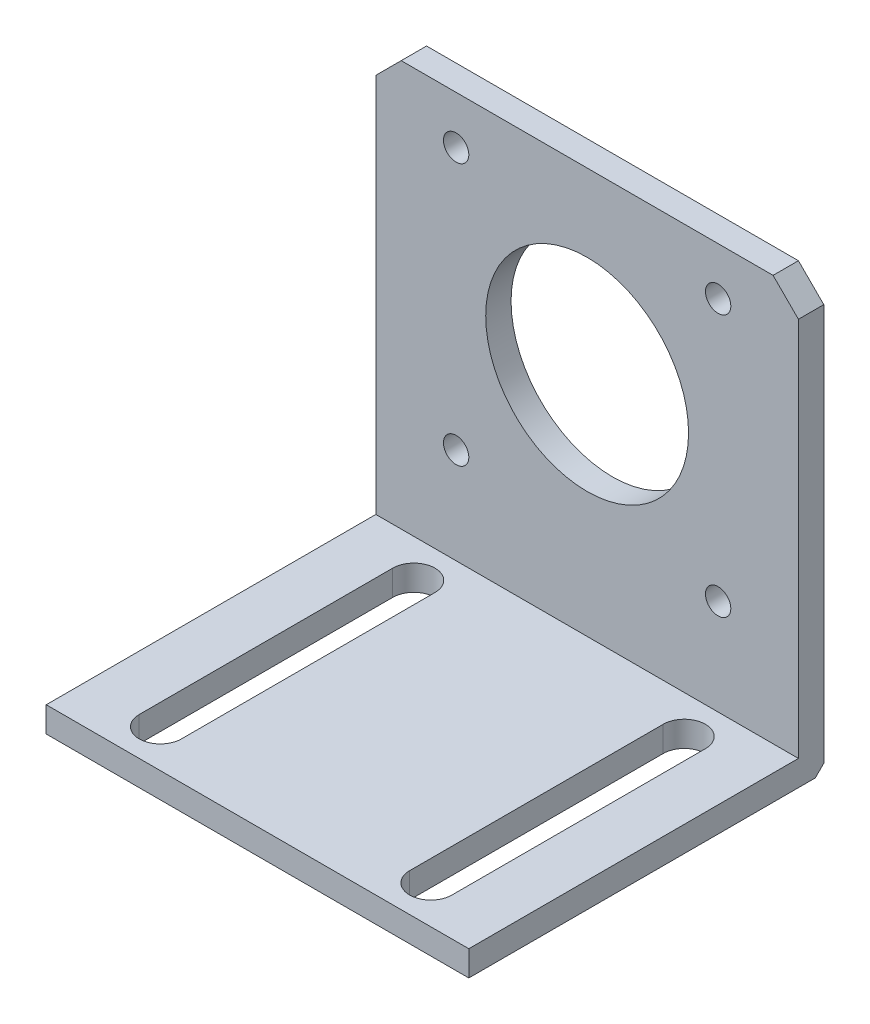
ISO-10303-21;
HEADER;
FILE_DESCRIPTION(('STEP AP214'),'2;1');
FILE_NAME('part.step','',(''),(''),'','','');
FILE_SCHEMA(('AUTOMOTIVE_DESIGN { 1 0 10303 214 1 1 1 1 }'));
ENDSEC;
DATA;
#1=APPLICATION_CONTEXT('core data for automotive mechanical design processes');
#2=APPLICATION_PROTOCOL_DEFINITION('international standard','automotive_design',2000,#1);
#3=PRODUCT_CONTEXT('',#1,'mechanical');
#4=PRODUCT('Part','Part','',(#3));
#5=PRODUCT_RELATED_PRODUCT_CATEGORY('part','',(#4));
#6=PRODUCT_DEFINITION_FORMATION('','',#4);
#7=PRODUCT_DEFINITION_CONTEXT('part definition',#1,'design');
#8=PRODUCT_DEFINITION('design','',#6,#7);
#9=PRODUCT_DEFINITION_SHAPE('','',#8);
#10=(LENGTH_UNIT() NAMED_UNIT(*) SI_UNIT(.MILLI.,.METRE.));
#11=(NAMED_UNIT(*) PLANE_ANGLE_UNIT() SI_UNIT($,.RADIAN.));
#12=(NAMED_UNIT(*) SI_UNIT($,.STERADIAN.) SOLID_ANGLE_UNIT());
#13=UNCERTAINTY_MEASURE_WITH_UNIT(LENGTH_MEASURE(1.E-05),#10,'distance_accuracy_value','');
#14=(GEOMETRIC_REPRESENTATION_CONTEXT(3) GLOBAL_UNCERTAINTY_ASSIGNED_CONTEXT((#13)) GLOBAL_UNIT_ASSIGNED_CONTEXT((#10,
#11,#12)) REPRESENTATION_CONTEXT('',''));
#15=CARTESIAN_POINT('',(0.,0.,0.));
#16=DIRECTION('',(0.,0.,1.));
#17=DIRECTION('',(1.,0.,0.));
#18=AXIS2_PLACEMENT_3D('',#15,#16,#17);
#19=CARTESIAN_POINT('',(0.,0.,3.));
#20=DIRECTION('',(0.,0.,1.));
#21=DIRECTION('',(1.,0.,0.));
#22=AXIS2_PLACEMENT_3D('',#19,#20,#21);
#23=PLANE('',#22);
#24=DIRECTION('',(-1.,0.,0.));
#25=VECTOR('',#24,1.);
#26=CARTESIAN_POINT('',(-25.,-26.85,3.));
#27=LINE('',#26,#25);
#28=CARTESIAN_POINT('',(25.,-26.85,3.));
#29=VERTEX_POINT('',#28);
#30=CARTESIAN_POINT('',(-25.,-26.85,3.));
#31=VERTEX_POINT('',#30);
#32=EDGE_CURVE('E193',#29,#31,#27,.T.);
#33=ORIENTED_EDGE('',*,*,#32,.F.);
#34=DIRECTION('',(0.,1.,0.));
#35=VECTOR('',#34,1.);
#36=CARTESIAN_POINT('',(25.,18.15,3.));
#37=LINE('',#36,#35);
#38=CARTESIAN_POINT('',(25.,18.15,3.));
#39=VERTEX_POINT('',#38);
#40=EDGE_CURVE('E289',#29,#39,#37,.T.);
#41=ORIENTED_EDGE('',*,*,#40,.T.);
#42=DIRECTION('',(-0.707106781186548,0.707106781186548,0.));
#43=VECTOR('',#42,1.);
#44=CARTESIAN_POINT('',(25.,18.15,3.));
#45=LINE('',#44,#43);
#46=CARTESIAN_POINT('',(22.,21.15,3.));
#47=VERTEX_POINT('',#46);
#48=EDGE_CURVE('E291',#39,#47,#45,.T.);
#49=ORIENTED_EDGE('',*,*,#48,.T.);
#50=DIRECTION('',(-1.,0.,0.));
#51=VECTOR('',#50,1.);
#52=CARTESIAN_POINT('',(22.,21.15,3.));
#53=LINE('',#52,#51);
#54=CARTESIAN_POINT('',(-22.,21.15,3.));
#55=VERTEX_POINT('',#54);
#56=EDGE_CURVE('E281',#47,#55,#53,.T.);
#57=ORIENTED_EDGE('',*,*,#56,.T.);
#58=DIRECTION('',(-0.707106781186548,-0.707106781186548,0.));
#59=VECTOR('',#58,1.);
#60=CARTESIAN_POINT('',(-22.,21.15,3.));
#61=LINE('',#60,#59);
#62=CARTESIAN_POINT('',(-25.,18.15,3.));
#63=VERTEX_POINT('',#62);
#64=EDGE_CURVE('E284',#55,#63,#61,.T.);
#65=ORIENTED_EDGE('',*,*,#64,.T.);
#66=DIRECTION('',(0.,-1.,0.));
#67=VECTOR('',#66,1.);
#68=CARTESIAN_POINT('',(-25.,18.15,3.));
#69=LINE('',#68,#67);
#70=EDGE_CURVE('E287',#63,#31,#69,.T.);
#71=ORIENTED_EDGE('',*,*,#70,.T.);
#72=EDGE_LOOP('',(#33,#41,#49,#57,#65,#71));
#73=FACE_BOUND('',#72,.T.);
#74=CARTESIAN_POINT('',(-15.5,-15.5,3.));
#75=DIRECTION('',(0.,0.,1.));
#76=DIRECTION('',(-1.,0.,0.));
#77=AXIS2_PLACEMENT_3D('',#74,#75,#76);
#78=CIRCLE('',#77,1.5);
#79=CARTESIAN_POINT('',(-17.,-15.5,3.));
#80=VERTEX_POINT('',#79);
#81=EDGE_CURVE('E257',#80,#80,#78,.T.);
#82=ORIENTED_EDGE('',*,*,#81,.F.);
#83=EDGE_LOOP('',(#82));
#84=FACE_BOUND('',#83,.T.);
#85=CARTESIAN_POINT('',(0.,0.,3.));
#86=DIRECTION('',(0.,0.,1.));
#87=DIRECTION('',(1.,0.,0.));
#88=AXIS2_PLACEMENT_3D('',#85,#86,#87);
#89=CIRCLE('',#88,12.);
#90=CARTESIAN_POINT('',(12.,0.,3.));
#91=VERTEX_POINT('',#90);
#92=EDGE_CURVE('E269',#91,#91,#89,.T.);
#93=ORIENTED_EDGE('',*,*,#92,.F.);
#94=EDGE_LOOP('',(#93));
#95=FACE_BOUND('',#94,.T.);
#96=CARTESIAN_POINT('',(-15.5,15.5,3.));
#97=DIRECTION('',(0.,0.,1.));
#98=DIRECTION('',(1.,0.,0.));
#99=AXIS2_PLACEMENT_3D('',#96,#97,#98);
#100=CIRCLE('',#99,1.5);
#101=CARTESIAN_POINT('',(-14.,15.5,3.));
#102=VERTEX_POINT('',#101);
#103=EDGE_CURVE('E275',#102,#102,#100,.T.);
#104=ORIENTED_EDGE('',*,*,#103,.F.);
#105=EDGE_LOOP('',(#104));
#106=FACE_BOUND('',#105,.T.);
#107=CARTESIAN_POINT('',(15.5,15.5,3.));
#108=DIRECTION('',(0.,0.,1.));
#109=DIRECTION('',(-1.,0.,0.));
#110=AXIS2_PLACEMENT_3D('',#107,#108,#109);
#111=CIRCLE('',#110,1.5);
#112=CARTESIAN_POINT('',(14.,15.5,3.));
#113=VERTEX_POINT('',#112);
#114=EDGE_CURVE('E263',#113,#113,#111,.T.);
#115=ORIENTED_EDGE('',*,*,#114,.F.);
#116=EDGE_LOOP('',(#115));
#117=FACE_BOUND('',#116,.T.);
#118=CARTESIAN_POINT('',(15.5,-15.5,3.));
#119=DIRECTION('',(0.,0.,1.));
#120=DIRECTION('',(1.,0.,0.));
#121=AXIS2_PLACEMENT_3D('',#118,#119,#120);
#122=CIRCLE('',#121,1.5);
#123=CARTESIAN_POINT('',(17.,-15.5,3.));
#124=VERTEX_POINT('',#123);
#125=EDGE_CURVE('E251',#124,#124,#122,.T.);
#126=ORIENTED_EDGE('',*,*,#125,.F.);
#127=EDGE_LOOP('',(#126));
#128=FACE_BOUND('',#127,.T.);
#129=ADVANCED_FACE('F37',(#73,#84,#95,#106,#117,#128),#23,.T.);
#130=CARTESIAN_POINT('',(0.,0.,0.));
#131=DIRECTION('',(0.,0.,1.));
#132=DIRECTION('',(1.,0.,0.));
#133=AXIS2_PLACEMENT_3D('',#130,#131,#132);
#134=PLANE('',#133);
#135=DIRECTION('',(0.,1.,0.));
#136=VECTOR('',#135,1.);
#137=CARTESIAN_POINT('',(25.,18.15,0.));
#138=LINE('',#137,#136);
#139=CARTESIAN_POINT('',(25.,-28.85,0.));
#140=VERTEX_POINT('',#139);
#141=CARTESIAN_POINT('',(25.,18.15,0.));
#142=VERTEX_POINT('',#141);
#143=EDGE_CURVE('E301',#140,#142,#138,.T.);
#144=ORIENTED_EDGE('',*,*,#143,.F.);
#145=DIRECTION('',(-1.,0.,0.));
#146=VECTOR('',#145,1.);
#147=CARTESIAN_POINT('',(-25.,-28.85,0.));
#148=LINE('',#147,#146);
#149=CARTESIAN_POINT('',(-25.,-28.85,0.));
#150=VERTEX_POINT('',#149);
#151=EDGE_CURVE('E315',#140,#150,#148,.T.);
#152=ORIENTED_EDGE('',*,*,#151,.T.);
#153=DIRECTION('',(0.,-1.,0.));
#154=VECTOR('',#153,1.);
#155=CARTESIAN_POINT('',(-25.,18.15,0.));
#156=LINE('',#155,#154);
#157=CARTESIAN_POINT('',(-25.,18.15,0.));
#158=VERTEX_POINT('',#157);
#159=EDGE_CURVE('E298',#158,#150,#156,.T.);
#160=ORIENTED_EDGE('',*,*,#159,.F.);
#161=DIRECTION('',(-0.707106781186548,-0.707106781186548,0.));
#162=VECTOR('',#161,1.);
#163=CARTESIAN_POINT('',(-22.,21.15,0.));
#164=LINE('',#163,#162);
#165=CARTESIAN_POINT('',(-22.,21.15,0.));
#166=VERTEX_POINT('',#165);
#167=EDGE_CURVE('E296',#166,#158,#164,.T.);
#168=ORIENTED_EDGE('',*,*,#167,.F.);
#169=DIRECTION('',(-1.,0.,0.));
#170=VECTOR('',#169,1.);
#171=CARTESIAN_POINT('',(22.,21.15,0.));
#172=LINE('',#171,#170);
#173=CARTESIAN_POINT('',(22.,21.15,0.));
#174=VERTEX_POINT('',#173);
#175=EDGE_CURVE('E278',#174,#166,#172,.T.);
#176=ORIENTED_EDGE('',*,*,#175,.F.);
#177=DIRECTION('',(-0.707106781186548,0.707106781186548,0.));
#178=VECTOR('',#177,1.);
#179=CARTESIAN_POINT('',(25.,18.15,0.));
#180=LINE('',#179,#178);
#181=EDGE_CURVE('E285',#142,#174,#180,.T.);
#182=ORIENTED_EDGE('',*,*,#181,.F.);
#183=EDGE_LOOP('',(#144,#152,#160,#168,#176,#182));
#184=FACE_BOUND('',#183,.T.);
#185=CARTESIAN_POINT('',(-15.5,15.5,0.));
#186=DIRECTION('',(0.,0.,1.));
#187=DIRECTION('',(1.,0.,0.));
#188=AXIS2_PLACEMENT_3D('',#185,#186,#187);
#189=CIRCLE('',#188,1.5);
#190=CARTESIAN_POINT('',(-14.,15.5,0.));
#191=VERTEX_POINT('',#190);
#192=EDGE_CURVE('E272',#191,#191,#189,.T.);
#193=ORIENTED_EDGE('',*,*,#192,.T.);
#194=EDGE_LOOP('',(#193));
#195=FACE_BOUND('',#194,.T.);
#196=CARTESIAN_POINT('',(0.,0.,0.));
#197=DIRECTION('',(0.,0.,1.));
#198=DIRECTION('',(1.,0.,0.));
#199=AXIS2_PLACEMENT_3D('',#196,#197,#198);
#200=CIRCLE('',#199,12.);
#201=CARTESIAN_POINT('',(12.,0.,0.));
#202=VERTEX_POINT('',#201);
#203=EDGE_CURVE('E266',#202,#202,#200,.T.);
#204=ORIENTED_EDGE('',*,*,#203,.T.);
#205=EDGE_LOOP('',(#204));
#206=FACE_BOUND('',#205,.T.);
#207=CARTESIAN_POINT('',(15.5,15.5,0.));
#208=DIRECTION('',(0.,0.,1.));
#209=DIRECTION('',(-1.,0.,0.));
#210=AXIS2_PLACEMENT_3D('',#207,#208,#209);
#211=CIRCLE('',#210,1.5);
#212=CARTESIAN_POINT('',(14.,15.5,0.));
#213=VERTEX_POINT('',#212);
#214=EDGE_CURVE('E260',#213,#213,#211,.T.);
#215=ORIENTED_EDGE('',*,*,#214,.T.);
#216=EDGE_LOOP('',(#215));
#217=FACE_BOUND('',#216,.T.);
#218=CARTESIAN_POINT('',(-15.5,-15.5,0.));
#219=DIRECTION('',(0.,0.,1.));
#220=DIRECTION('',(-1.,0.,0.));
#221=AXIS2_PLACEMENT_3D('',#218,#219,#220);
#222=CIRCLE('',#221,1.5);
#223=CARTESIAN_POINT('',(-17.,-15.5,0.));
#224=VERTEX_POINT('',#223);
#225=EDGE_CURVE('E254',#224,#224,#222,.T.);
#226=ORIENTED_EDGE('',*,*,#225,.T.);
#227=EDGE_LOOP('',(#226));
#228=FACE_BOUND('',#227,.T.);
#229=CARTESIAN_POINT('',(15.5,-15.5,0.));
#230=DIRECTION('',(0.,0.,1.));
#231=DIRECTION('',(1.,0.,0.));
#232=AXIS2_PLACEMENT_3D('',#229,#230,#231);
#233=CIRCLE('',#232,1.5);
#234=CARTESIAN_POINT('',(17.,-15.5,0.));
#235=VERTEX_POINT('',#234);
#236=EDGE_CURVE('E248',#235,#235,#233,.T.);
#237=ORIENTED_EDGE('',*,*,#236,.T.);
#238=EDGE_LOOP('',(#237));
#239=FACE_BOUND('',#238,.T.);
#240=ADVANCED_FACE('F332',(#184,#195,#206,#217,#228,#239),#134,.F.);
#241=CARTESIAN_POINT('',(22.,21.15,3.));
#242=DIRECTION('',(0.,-1.,0.));
#243=DIRECTION('',(1.,0.,0.));
#244=AXIS2_PLACEMENT_3D('',#241,#242,#243);
#245=PLANE('',#244);
#246=ORIENTED_EDGE('',*,*,#175,.T.);
#247=DIRECTION('',(0.,0.,-1.));
#248=VECTOR('',#247,1.);
#249=CARTESIAN_POINT('',(-22.,21.15,3.));
#250=LINE('',#249,#248);
#251=EDGE_CURVE('E312',#55,#166,#250,.T.);
#252=ORIENTED_EDGE('',*,*,#251,.F.);
#253=ORIENTED_EDGE('',*,*,#56,.F.);
#254=DIRECTION('',(0.,0.,-1.));
#255=VECTOR('',#254,1.);
#256=CARTESIAN_POINT('',(22.,21.15,3.));
#257=LINE('',#256,#255);
#258=EDGE_CURVE('E293',#47,#174,#257,.T.);
#259=ORIENTED_EDGE('',*,*,#258,.T.);
#260=EDGE_LOOP('',(#246,#252,#253,#259));
#261=FACE_BOUND('',#260,.T.);
#262=ADVANCED_FACE('F344',(#261),#245,.F.);
#263=CARTESIAN_POINT('',(-22.,21.15,3.));
#264=DIRECTION('',(0.707106781186547,-0.707106781186547,0.));
#265=DIRECTION('',(0.707106781186548,0.707106781186548,0.));
#266=AXIS2_PLACEMENT_3D('',#263,#264,#265);
#267=PLANE('',#266);
#268=ORIENTED_EDGE('',*,*,#167,.T.);
#269=DIRECTION('',(0.,0.,-1.));
#270=VECTOR('',#269,1.);
#271=CARTESIAN_POINT('',(-25.,18.15,3.));
#272=LINE('',#271,#270);
#273=EDGE_CURVE('E309',#63,#158,#272,.T.);
#274=ORIENTED_EDGE('',*,*,#273,.F.);
#275=ORIENTED_EDGE('',*,*,#64,.F.);
#276=ORIENTED_EDGE('',*,*,#251,.T.);
#277=EDGE_LOOP('',(#268,#274,#275,#276));
#278=FACE_BOUND('',#277,.T.);
#279=ADVANCED_FACE('F340',(#278),#267,.F.);
#280=CARTESIAN_POINT('',(-25.,18.15,3.));
#281=DIRECTION('',(1.,0.,0.));
#282=DIRECTION('',(0.,1.,0.));
#283=AXIS2_PLACEMENT_3D('',#280,#281,#282);
#284=PLANE('',#283);
#285=ORIENTED_EDGE('',*,*,#159,.T.);
#286=DIRECTION('',(0.,-0.707106781186548,0.707106781186548));
#287=VECTOR('',#286,1.);
#288=CARTESIAN_POINT('',(-25.,-28.85,0.));
#289=LINE('',#288,#287);
#290=CARTESIAN_POINT('',(-25.,-29.85,0.999999999999994));
#291=VERTEX_POINT('',#290);
#292=EDGE_CURVE('E318',#150,#291,#289,.T.);
#293=ORIENTED_EDGE('',*,*,#292,.T.);
#294=DIRECTION('',(0.,0.,-1.));
#295=VECTOR('',#294,1.);
#296=CARTESIAN_POINT('',(-25.,-29.85,3.));
#297=LINE('',#296,#295);
#298=CARTESIAN_POINT('',(-25.,-29.85,42.));
#299=VERTEX_POINT('',#298);
#300=EDGE_CURVE('E245',#299,#291,#297,.T.);
#301=ORIENTED_EDGE('',*,*,#300,.F.);
#302=DIRECTION('',(0.,-1.,0.));
#303=VECTOR('',#302,1.);
#304=CARTESIAN_POINT('',(-25.,-29.85,42.));
#305=LINE('',#304,#303);
#306=CARTESIAN_POINT('',(-25.,-26.85,42.));
#307=VERTEX_POINT('',#306);
#308=EDGE_CURVE('E233',#307,#299,#305,.T.);
#309=ORIENTED_EDGE('',*,*,#308,.F.);
#310=DIRECTION('',(0.,0.,-1.));
#311=VECTOR('',#310,1.);
#312=CARTESIAN_POINT('',(-25.,-26.85,42.));
#313=LINE('',#312,#311);
#314=EDGE_CURVE('E236',#307,#31,#313,.T.);
#315=ORIENTED_EDGE('',*,*,#314,.T.);
#316=ORIENTED_EDGE('',*,*,#70,.F.);
#317=ORIENTED_EDGE('',*,*,#273,.T.);
#318=EDGE_LOOP('',(#285,#293,#301,#309,#315,#316,#317));
#319=FACE_BOUND('',#318,.T.);
#320=ADVANCED_FACE('F336',(#319),#284,.F.);
#321=CARTESIAN_POINT('',(25.,18.15,3.));
#322=DIRECTION('',(-1.,0.,0.));
#323=DIRECTION('',(0.,-1.,0.));
#324=AXIS2_PLACEMENT_3D('',#321,#322,#323);
#325=PLANE('',#324);
#326=DIRECTION('',(0.,0.,-1.));
#327=VECTOR('',#326,1.);
#328=CARTESIAN_POINT('',(25.,-29.85,3.));
#329=LINE('',#328,#327);
#330=CARTESIAN_POINT('',(25.,-29.85,42.));
#331=VERTEX_POINT('',#330);
#332=CARTESIAN_POINT('',(25.,-29.85,0.999999999999994));
#333=VERTEX_POINT('',#332);
#334=EDGE_CURVE('E244',#331,#333,#329,.T.);
#335=ORIENTED_EDGE('',*,*,#334,.T.);
#336=DIRECTION('',(0.,0.707106781186548,-0.707106781186548));
#337=VECTOR('',#336,1.);
#338=CARTESIAN_POINT('',(25.,-28.85,0.));
#339=LINE('',#338,#337);
#340=EDGE_CURVE('E11',#333,#140,#339,.T.);
#341=ORIENTED_EDGE('',*,*,#340,.T.);
#342=ORIENTED_EDGE('',*,*,#143,.T.);
#343=DIRECTION('',(0.,0.,-1.));
#344=VECTOR('',#343,1.);
#345=CARTESIAN_POINT('',(25.,18.15,3.));
#346=LINE('',#345,#344);
#347=EDGE_CURVE('E306',#39,#142,#346,.T.);
#348=ORIENTED_EDGE('',*,*,#347,.F.);
#349=ORIENTED_EDGE('',*,*,#40,.F.);
#350=DIRECTION('',(0.,0.,-1.));
#351=VECTOR('',#350,1.);
#352=CARTESIAN_POINT('',(25.,-26.85,42.));
#353=LINE('',#352,#351);
#354=CARTESIAN_POINT('',(25.,-26.85,42.));
#355=VERTEX_POINT('',#354);
#356=EDGE_CURVE('E241',#355,#29,#353,.T.);
#357=ORIENTED_EDGE('',*,*,#356,.F.);
#358=DIRECTION('',(0.,1.,0.));
#359=VECTOR('',#358,1.);
#360=CARTESIAN_POINT('',(25.,-26.85,42.));
#361=LINE('',#360,#359);
#362=EDGE_CURVE('E229',#331,#355,#361,.T.);
#363=ORIENTED_EDGE('',*,*,#362,.F.);
#364=EDGE_LOOP('',(#335,#341,#342,#348,#349,#357,#363));
#365=FACE_BOUND('',#364,.T.);
#366=ADVANCED_FACE('F326',(#365),#325,.F.);
#367=CARTESIAN_POINT('',(25.,18.15,3.));
#368=DIRECTION('',(-0.707106781186547,-0.707106781186547,0.));
#369=DIRECTION('',(0.707106781186548,-0.707106781186548,0.));
#370=AXIS2_PLACEMENT_3D('',#367,#368,#369);
#371=PLANE('',#370);
#372=ORIENTED_EDGE('',*,*,#181,.T.);
#373=ORIENTED_EDGE('',*,*,#258,.F.);
#374=ORIENTED_EDGE('',*,*,#48,.F.);
#375=ORIENTED_EDGE('',*,*,#347,.T.);
#376=EDGE_LOOP('',(#372,#373,#374,#375));
#377=FACE_BOUND('',#376,.T.);
#378=ADVANCED_FACE('F349',(#377),#371,.F.);
#379=CARTESIAN_POINT('',(-15.5,15.5,3.));
#380=DIRECTION('',(0.,0.,-1.));
#381=DIRECTION('',(-1.,0.,0.));
#382=AXIS2_PLACEMENT_3D('',#379,#380,#381);
#383=CYLINDRICAL_SURFACE('',#382,1.5);
#384=ORIENTED_EDGE('',*,*,#103,.T.);
#385=EDGE_LOOP('',(#384));
#386=FACE_BOUND('',#385,.T.);
#387=ORIENTED_EDGE('',*,*,#192,.F.);
#388=EDGE_LOOP('',(#387));
#389=FACE_BOUND('',#388,.T.);
#390=ADVANCED_FACE('F378',(#386,#389),#383,.F.);
#391=CARTESIAN_POINT('',(0.,0.,3.));
#392=DIRECTION('',(0.,0.,-1.));
#393=DIRECTION('',(-1.,0.,0.));
#394=AXIS2_PLACEMENT_3D('',#391,#392,#393);
#395=CYLINDRICAL_SURFACE('',#394,12.);
#396=ORIENTED_EDGE('',*,*,#92,.T.);
#397=EDGE_LOOP('',(#396));
#398=FACE_BOUND('',#397,.T.);
#399=ORIENTED_EDGE('',*,*,#203,.F.);
#400=EDGE_LOOP('',(#399));
#401=FACE_BOUND('',#400,.T.);
#402=ADVANCED_FACE('F416',(#398,#401),#395,.F.);
#403=CARTESIAN_POINT('',(15.5,15.5,3.));
#404=DIRECTION('',(0.,0.,-1.));
#405=DIRECTION('',(-1.,0.,0.));
#406=AXIS2_PLACEMENT_3D('',#403,#404,#405);
#407=CYLINDRICAL_SURFACE('',#406,1.5);
#408=ORIENTED_EDGE('',*,*,#114,.T.);
#409=EDGE_LOOP('',(#408));
#410=FACE_BOUND('',#409,.T.);
#411=ORIENTED_EDGE('',*,*,#214,.F.);
#412=EDGE_LOOP('',(#411));
#413=FACE_BOUND('',#412,.T.);
#414=ADVANCED_FACE('F423',(#410,#413),#407,.F.);
#415=CARTESIAN_POINT('',(-15.5,-15.5,3.));
#416=DIRECTION('',(0.,0.,-1.));
#417=DIRECTION('',(-1.,0.,0.));
#418=AXIS2_PLACEMENT_3D('',#415,#416,#417);
#419=CYLINDRICAL_SURFACE('',#418,1.5);
#420=ORIENTED_EDGE('',*,*,#81,.T.);
#421=EDGE_LOOP('',(#420));
#422=FACE_BOUND('',#421,.T.);
#423=ORIENTED_EDGE('',*,*,#225,.F.);
#424=EDGE_LOOP('',(#423));
#425=FACE_BOUND('',#424,.T.);
#426=ADVANCED_FACE('F430',(#422,#425),#419,.F.);
#427=CARTESIAN_POINT('',(15.5,-15.5,3.));
#428=DIRECTION('',(0.,0.,-1.));
#429=DIRECTION('',(-1.,0.,0.));
#430=AXIS2_PLACEMENT_3D('',#427,#428,#429);
#431=CYLINDRICAL_SURFACE('',#430,1.5);
#432=ORIENTED_EDGE('',*,*,#125,.T.);
#433=EDGE_LOOP('',(#432));
#434=FACE_BOUND('',#433,.T.);
#435=ORIENTED_EDGE('',*,*,#236,.F.);
#436=EDGE_LOOP('',(#435));
#437=FACE_BOUND('',#436,.T.);
#438=ADVANCED_FACE('F438',(#434,#437),#431,.F.);
#439=CARTESIAN_POINT('',(25.,-29.85,3.));
#440=DIRECTION('',(0.,-1.,0.));
#441=DIRECTION('',(0.,0.,-1.));
#442=AXIS2_PLACEMENT_3D('',#439,#440,#441);
#443=PLANE('',#442);
#444=CARTESIAN_POINT('',(16.,-29.85,7.49999999999999));
#445=DIRECTION('',(0.,1.,0.));
#446=DIRECTION('',(0.,0.,1.));
#447=AXIS2_PLACEMENT_3D('',#444,#445,#446);
#448=CIRCLE('',#447,2.49999999999999);
#449=CARTESIAN_POINT('',(18.5,-29.85,7.49999999999999));
#450=VERTEX_POINT('',#449);
#451=CARTESIAN_POINT('',(13.5,-29.85,7.49999999999997));
#452=VERTEX_POINT('',#451);
#453=EDGE_CURVE('E159',#450,#452,#448,.T.);
#454=ORIENTED_EDGE('',*,*,#453,.T.);
#455=DIRECTION('',(0.,0.,1.));
#456=VECTOR('',#455,1.);
#457=CARTESIAN_POINT('',(13.5,-29.85,7.49999999999997));
#458=LINE('',#457,#456);
#459=CARTESIAN_POINT('',(13.5,-29.85,37.5));
#460=VERTEX_POINT('',#459);
#461=EDGE_CURVE('E170',#452,#460,#458,.T.);
#462=ORIENTED_EDGE('',*,*,#461,.T.);
#463=CARTESIAN_POINT('',(16.,-29.85,37.5));
#464=DIRECTION('',(0.,1.,0.));
#465=DIRECTION('',(0.,0.,1.));
#466=AXIS2_PLACEMENT_3D('',#463,#464,#465);
#467=CIRCLE('',#466,2.49999999999999);
#468=CARTESIAN_POINT('',(18.5,-29.85,37.5));
#469=VERTEX_POINT('',#468);
#470=EDGE_CURVE('E52',#460,#469,#467,.T.);
#471=ORIENTED_EDGE('',*,*,#470,.T.);
#472=DIRECTION('',(0.,0.,-1.));
#473=VECTOR('',#472,1.);
#474=CARTESIAN_POINT('',(18.5,-29.85,7.49999999999999));
#475=LINE('',#474,#473);
#476=EDGE_CURVE('E167',#469,#450,#475,.T.);
#477=ORIENTED_EDGE('',*,*,#476,.T.);
#478=EDGE_LOOP('',(#454,#462,#471,#477));
#479=FACE_BOUND('',#478,.T.);
#480=CARTESIAN_POINT('',(-16.,-29.85,7.49999999999999));
#481=DIRECTION('',(0.,1.,0.));
#482=DIRECTION('',(0.,0.,-1.));
#483=AXIS2_PLACEMENT_3D('',#480,#481,#482);
#484=CIRCLE('',#483,2.49999999999998);
#485=CARTESIAN_POINT('',(-13.5,-29.85,7.49999999999998));
#486=VERTEX_POINT('',#485);
#487=CARTESIAN_POINT('',(-18.5,-29.85,7.49999999999999));
#488=VERTEX_POINT('',#487);
#489=EDGE_CURVE('E197',#486,#488,#484,.T.);
#490=ORIENTED_EDGE('',*,*,#489,.T.);
#491=DIRECTION('',(0.,0.,1.));
#492=VECTOR('',#491,1.);
#493=CARTESIAN_POINT('',(-18.5,-29.85,7.49999999999999));
#494=LINE('',#493,#492);
#495=CARTESIAN_POINT('',(-18.5,-29.85,37.5));
#496=VERTEX_POINT('',#495);
#497=EDGE_CURVE('E200',#488,#496,#494,.T.);
#498=ORIENTED_EDGE('',*,*,#497,.T.);
#499=CARTESIAN_POINT('',(-16.,-29.85,37.5));
#500=DIRECTION('',(0.,1.,0.));
#501=DIRECTION('',(0.,0.,-1.));
#502=AXIS2_PLACEMENT_3D('',#499,#500,#501);
#503=CIRCLE('',#502,2.49999999999998);
#504=CARTESIAN_POINT('',(-13.5,-29.85,37.5));
#505=VERTEX_POINT('',#504);
#506=EDGE_CURVE('E60',#496,#505,#503,.T.);
#507=ORIENTED_EDGE('',*,*,#506,.T.);
#508=DIRECTION('',(0.,0.,-1.));
#509=VECTOR('',#508,1.);
#510=CARTESIAN_POINT('',(-13.5,-29.85,7.49999999999998));
#511=LINE('',#510,#509);
#512=EDGE_CURVE('E205',#505,#486,#511,.T.);
#513=ORIENTED_EDGE('',*,*,#512,.T.);
#514=EDGE_LOOP('',(#490,#498,#507,#513));
#515=FACE_BOUND('',#514,.T.);
#516=ORIENTED_EDGE('',*,*,#300,.T.);
#517=DIRECTION('',(1.,0.,0.));
#518=VECTOR('',#517,1.);
#519=CARTESIAN_POINT('',(25.,-29.85,0.999999999999994));
#520=LINE('',#519,#518);
#521=EDGE_CURVE('E45',#291,#333,#520,.T.);
#522=ORIENTED_EDGE('',*,*,#521,.T.);
#523=ORIENTED_EDGE('',*,*,#334,.F.);
#524=DIRECTION('',(1.,0.,0.));
#525=VECTOR('',#524,1.);
#526=CARTESIAN_POINT('',(25.,-29.85,42.));
#527=LINE('',#526,#525);
#528=EDGE_CURVE('E226',#299,#331,#527,.T.);
#529=ORIENTED_EDGE('',*,*,#528,.F.);
#530=EDGE_LOOP('',(#516,#522,#523,#529));
#531=FACE_BOUND('',#530,.T.);
#532=ADVANCED_FACE('F174',(#479,#515,#531),#443,.T.);
#533=CARTESIAN_POINT('',(-25.,-26.85,42.));
#534=DIRECTION('',(0.,-1.,0.));
#535=DIRECTION('',(0.,0.,-1.));
#536=AXIS2_PLACEMENT_3D('',#533,#534,#535);
#537=PLANE('',#536);
#538=DIRECTION('',(0.,0.,1.));
#539=VECTOR('',#538,1.);
#540=CARTESIAN_POINT('',(13.5,-26.85,7.49999999999997));
#541=LINE('',#540,#539);
#542=CARTESIAN_POINT('',(13.5,-26.85,7.49999999999997));
#543=VERTEX_POINT('',#542);
#544=CARTESIAN_POINT('',(13.5,-26.85,37.5));
#545=VERTEX_POINT('',#544);
#546=EDGE_CURVE('E186',#543,#545,#541,.T.);
#547=ORIENTED_EDGE('',*,*,#546,.F.);
#548=CARTESIAN_POINT('',(16.,-26.85,7.49999999999999));
#549=DIRECTION('',(0.,1.,0.));
#550=DIRECTION('',(0.,0.,1.));
#551=AXIS2_PLACEMENT_3D('',#548,#549,#550);
#552=CIRCLE('',#551,2.49999999999999);
#553=CARTESIAN_POINT('',(18.5,-26.85,7.49999999999999));
#554=VERTEX_POINT('',#553);
#555=EDGE_CURVE('E162',#554,#543,#552,.T.);
#556=ORIENTED_EDGE('',*,*,#555,.F.);
#557=DIRECTION('',(0.,0.,-1.));
#558=VECTOR('',#557,1.);
#559=CARTESIAN_POINT('',(18.5,-26.85,7.49999999999999));
#560=LINE('',#559,#558);
#561=CARTESIAN_POINT('',(18.5,-26.85,37.5));
#562=VERTEX_POINT('',#561);
#563=EDGE_CURVE('E177',#562,#554,#560,.T.);
#564=ORIENTED_EDGE('',*,*,#563,.F.);
#565=CARTESIAN_POINT('',(16.,-26.85,37.5));
#566=DIRECTION('',(0.,1.,0.));
#567=DIRECTION('',(0.,0.,1.));
#568=AXIS2_PLACEMENT_3D('',#565,#566,#567);
#569=CIRCLE('',#568,2.49999999999999);
#570=EDGE_CURVE('E180',#545,#562,#569,.T.);
#571=ORIENTED_EDGE('',*,*,#570,.F.);
#572=EDGE_LOOP('',(#547,#556,#564,#571));
#573=FACE_BOUND('',#572,.T.);
#574=DIRECTION('',(0.,0.,1.));
#575=VECTOR('',#574,1.);
#576=CARTESIAN_POINT('',(-18.5,-26.85,7.49999999999999));
#577=LINE('',#576,#575);
#578=CARTESIAN_POINT('',(-18.5,-26.85,7.49999999999999));
#579=VERTEX_POINT('',#578);
#580=CARTESIAN_POINT('',(-18.5,-26.85,37.5));
#581=VERTEX_POINT('',#580);
#582=EDGE_CURVE('E211',#579,#581,#577,.T.);
#583=ORIENTED_EDGE('',*,*,#582,.F.);
#584=CARTESIAN_POINT('',(-16.,-26.85,7.49999999999999));
#585=DIRECTION('',(0.,1.,0.));
#586=DIRECTION('',(0.,0.,-1.));
#587=AXIS2_PLACEMENT_3D('',#584,#585,#586);
#588=CIRCLE('',#587,2.49999999999998);
#589=CARTESIAN_POINT('',(-13.5,-26.85,7.49999999999998));
#590=VERTEX_POINT('',#589);
#591=EDGE_CURVE('E209',#590,#579,#588,.T.);
#592=ORIENTED_EDGE('',*,*,#591,.F.);
#593=DIRECTION('',(0.,0.,-1.));
#594=VECTOR('',#593,1.);
#595=CARTESIAN_POINT('',(-13.5,-26.85,7.49999999999998));
#596=LINE('',#595,#594);
#597=CARTESIAN_POINT('',(-13.5,-26.85,37.5));
#598=VERTEX_POINT('',#597);
#599=EDGE_CURVE('E201',#598,#590,#596,.T.);
#600=ORIENTED_EDGE('',*,*,#599,.F.);
#601=CARTESIAN_POINT('',(-16.,-26.85,37.5));
#602=DIRECTION('',(0.,1.,0.));
#603=DIRECTION('',(0.,0.,-1.));
#604=AXIS2_PLACEMENT_3D('',#601,#602,#603);
#605=CIRCLE('',#604,2.49999999999998);
#606=EDGE_CURVE('E214',#581,#598,#605,.T.);
#607=ORIENTED_EDGE('',*,*,#606,.F.);
#608=EDGE_LOOP('',(#583,#592,#600,#607));
#609=FACE_BOUND('',#608,.T.);
#610=ORIENTED_EDGE('',*,*,#32,.T.);
#611=ORIENTED_EDGE('',*,*,#314,.F.);
#612=DIRECTION('',(-1.,0.,0.));
#613=VECTOR('',#612,1.);
#614=CARTESIAN_POINT('',(-25.,-26.85,42.));
#615=LINE('',#614,#613);
#616=EDGE_CURVE('E231',#355,#307,#615,.T.);
#617=ORIENTED_EDGE('',*,*,#616,.F.);
#618=ORIENTED_EDGE('',*,*,#356,.T.);
#619=EDGE_LOOP('',(#610,#611,#617,#618));
#620=FACE_BOUND('',#619,.T.);
#621=ADVANCED_FACE('F355',(#573,#609,#620),#537,.F.);
#622=CARTESIAN_POINT('',(0.,0.,42.));
#623=DIRECTION('',(0.,0.,-1.));
#624=DIRECTION('',(-1.,0.,0.));
#625=AXIS2_PLACEMENT_3D('',#622,#623,#624);
#626=PLANE('',#625);
#627=ORIENTED_EDGE('',*,*,#528,.T.);
#628=ORIENTED_EDGE('',*,*,#362,.T.);
#629=ORIENTED_EDGE('',*,*,#616,.T.);
#630=ORIENTED_EDGE('',*,*,#308,.T.);
#631=EDGE_LOOP('',(#627,#628,#629,#630));
#632=FACE_BOUND('',#631,.T.);
#633=ADVANCED_FACE('F359',(#632),#626,.F.);
#634=CARTESIAN_POINT('',(0.,-28.85,0.));
#635=DIRECTION('',(0.,-0.707106781186547,-0.707106781186547));
#636=DIRECTION('',(1.,0.,0.));
#637=AXIS2_PLACEMENT_3D('',#634,#635,#636);
#638=PLANE('',#637);
#639=ORIENTED_EDGE('',*,*,#340,.F.);
#640=ORIENTED_EDGE('',*,*,#521,.F.);
#641=ORIENTED_EDGE('',*,*,#292,.F.);
#642=ORIENTED_EDGE('',*,*,#151,.F.);
#643=EDGE_LOOP('',(#639,#640,#641,#642));
#644=FACE_BOUND('',#643,.T.);
#645=ADVANCED_FACE('F39',(#644),#638,.T.);
#646=CARTESIAN_POINT('',(-16.,-29.85,7.49999999999999));
#647=DIRECTION('',(0.,1.,0.));
#648=DIRECTION('',(0.,0.,1.));
#649=AXIS2_PLACEMENT_3D('',#646,#647,#648);
#650=CYLINDRICAL_SURFACE('',#649,2.49999999999998);
#651=ORIENTED_EDGE('',*,*,#591,.T.);
#652=DIRECTION('',(0.,1.,0.));
#653=VECTOR('',#652,1.);
#654=CARTESIAN_POINT('',(-18.5,-29.85,7.49999999999999));
#655=LINE('',#654,#653);
#656=EDGE_CURVE('E208',#488,#579,#655,.T.);
#657=ORIENTED_EDGE('',*,*,#656,.F.);
#658=ORIENTED_EDGE('',*,*,#489,.F.);
#659=DIRECTION('',(0.,1.,0.));
#660=VECTOR('',#659,1.);
#661=CARTESIAN_POINT('',(-13.5,-29.85,7.49999999999998));
#662=LINE('',#661,#660);
#663=EDGE_CURVE('E187',#486,#590,#662,.T.);
#664=ORIENTED_EDGE('',*,*,#663,.T.);
#665=EDGE_LOOP('',(#651,#657,#658,#664));
#666=FACE_BOUND('',#665,.T.);
#667=ADVANCED_FACE('F366',(#666),#650,.F.);
#668=CARTESIAN_POINT('',(-13.5,-29.85,7.49999999999998));
#669=DIRECTION('',(1.,0.,0.));
#670=DIRECTION('',(0.,0.,-1.));
#671=AXIS2_PLACEMENT_3D('',#668,#669,#670);
#672=PLANE('',#671);
#673=ORIENTED_EDGE('',*,*,#599,.T.);
#674=ORIENTED_EDGE('',*,*,#663,.F.);
#675=ORIENTED_EDGE('',*,*,#512,.F.);
#676=DIRECTION('',(0.,1.,0.));
#677=VECTOR('',#676,1.);
#678=CARTESIAN_POINT('',(-13.5,-29.85,37.5));
#679=LINE('',#678,#677);
#680=EDGE_CURVE('E220',#505,#598,#679,.T.);
#681=ORIENTED_EDGE('',*,*,#680,.T.);
#682=EDGE_LOOP('',(#673,#674,#675,#681));
#683=FACE_BOUND('',#682,.T.);
#684=ADVANCED_FACE('F467',(#683),#672,.F.);
#685=CARTESIAN_POINT('',(-16.,-29.85,37.5));
#686=DIRECTION('',(0.,1.,0.));
#687=DIRECTION('',(0.,0.,1.));
#688=AXIS2_PLACEMENT_3D('',#685,#686,#687);
#689=CYLINDRICAL_SURFACE('',#688,2.49999999999998);
#690=ORIENTED_EDGE('',*,*,#606,.T.);
#691=ORIENTED_EDGE('',*,*,#680,.F.);
#692=ORIENTED_EDGE('',*,*,#506,.F.);
#693=DIRECTION('',(0.,1.,0.));
#694=VECTOR('',#693,1.);
#695=CARTESIAN_POINT('',(-18.5,-29.85,37.5));
#696=LINE('',#695,#694);
#697=EDGE_CURVE('E222',#496,#581,#696,.T.);
#698=ORIENTED_EDGE('',*,*,#697,.T.);
#699=EDGE_LOOP('',(#690,#691,#692,#698));
#700=FACE_BOUND('',#699,.T.);
#701=ADVANCED_FACE('F477',(#700),#689,.F.);
#702=CARTESIAN_POINT('',(-18.5,-29.85,7.49999999999999));
#703=DIRECTION('',(-1.,0.,0.));
#704=DIRECTION('',(0.,0.,1.));
#705=AXIS2_PLACEMENT_3D('',#702,#703,#704);
#706=PLANE('',#705);
#707=ORIENTED_EDGE('',*,*,#582,.T.);
#708=ORIENTED_EDGE('',*,*,#697,.F.);
#709=ORIENTED_EDGE('',*,*,#497,.F.);
#710=ORIENTED_EDGE('',*,*,#656,.T.);
#711=EDGE_LOOP('',(#707,#708,#709,#710));
#712=FACE_BOUND('',#711,.T.);
#713=ADVANCED_FACE('F487',(#712),#706,.F.);
#714=CARTESIAN_POINT('',(16.,-29.85,7.49999999999999));
#715=DIRECTION('',(0.,1.,0.));
#716=DIRECTION('',(0.,0.,1.));
#717=AXIS2_PLACEMENT_3D('',#714,#715,#716);
#718=CYLINDRICAL_SURFACE('',#717,2.49999999999999);
#719=ORIENTED_EDGE('',*,*,#555,.T.);
#720=DIRECTION('',(0.,1.,0.));
#721=VECTOR('',#720,1.);
#722=CARTESIAN_POINT('',(13.5,-29.85,7.49999999999997));
#723=LINE('',#722,#721);
#724=EDGE_CURVE('E155',#452,#543,#723,.T.);
#725=ORIENTED_EDGE('',*,*,#724,.F.);
#726=ORIENTED_EDGE('',*,*,#453,.F.);
#727=DIRECTION('',(0.,1.,0.));
#728=VECTOR('',#727,1.);
#729=CARTESIAN_POINT('',(18.5,-29.85,7.49999999999999));
#730=LINE('',#729,#728);
#731=EDGE_CURVE('E191',#450,#554,#730,.T.);
#732=ORIENTED_EDGE('',*,*,#731,.T.);
#733=EDGE_LOOP('',(#719,#725,#726,#732));
#734=FACE_BOUND('',#733,.T.);
#735=ADVANCED_FACE('F157',(#734),#718,.F.);
#736=CARTESIAN_POINT('',(18.5,-29.85,7.49999999999999));
#737=DIRECTION('',(1.,0.,0.));
#738=DIRECTION('',(0.,0.,-1.));
#739=AXIS2_PLACEMENT_3D('',#736,#737,#738);
#740=PLANE('',#739);
#741=ORIENTED_EDGE('',*,*,#563,.T.);
#742=ORIENTED_EDGE('',*,*,#731,.F.);
#743=ORIENTED_EDGE('',*,*,#476,.F.);
#744=DIRECTION('',(0.,1.,0.));
#745=VECTOR('',#744,1.);
#746=CARTESIAN_POINT('',(18.5,-29.85,37.5));
#747=LINE('',#746,#745);
#748=EDGE_CURVE('E194',#469,#562,#747,.T.);
#749=ORIENTED_EDGE('',*,*,#748,.T.);
#750=EDGE_LOOP('',(#741,#742,#743,#749));
#751=FACE_BOUND('',#750,.T.);
#752=ADVANCED_FACE('F505',(#751),#740,.F.);
#753=CARTESIAN_POINT('',(16.,-29.85,37.5));
#754=DIRECTION('',(0.,1.,0.));
#755=DIRECTION('',(0.,0.,1.));
#756=AXIS2_PLACEMENT_3D('',#753,#754,#755);
#757=CYLINDRICAL_SURFACE('',#756,2.49999999999999);
#758=ORIENTED_EDGE('',*,*,#570,.T.);
#759=ORIENTED_EDGE('',*,*,#748,.F.);
#760=ORIENTED_EDGE('',*,*,#470,.F.);
#761=DIRECTION('',(0.,1.,0.));
#762=VECTOR('',#761,1.);
#763=CARTESIAN_POINT('',(13.5,-29.85,37.5));
#764=LINE('',#763,#762);
#765=EDGE_CURVE('E166',#460,#545,#764,.T.);
#766=ORIENTED_EDGE('',*,*,#765,.T.);
#767=EDGE_LOOP('',(#758,#759,#760,#766));
#768=FACE_BOUND('',#767,.T.);
#769=ADVANCED_FACE('F514',(#768),#757,.F.);
#770=CARTESIAN_POINT('',(13.5,-29.85,7.49999999999997));
#771=DIRECTION('',(-1.,0.,0.));
#772=DIRECTION('',(0.,0.,1.));
#773=AXIS2_PLACEMENT_3D('',#770,#771,#772);
#774=PLANE('',#773);
#775=ORIENTED_EDGE('',*,*,#546,.T.);
#776=ORIENTED_EDGE('',*,*,#765,.F.);
#777=ORIENTED_EDGE('',*,*,#461,.F.);
#778=ORIENTED_EDGE('',*,*,#724,.T.);
#779=EDGE_LOOP('',(#775,#776,#777,#778));
#780=FACE_BOUND('',#779,.T.);
#781=ADVANCED_FACE('F171',(#780),#774,.F.);
#782=CLOSED_SHELL('',(#129,#240,#262,#279,#320,#366,#378,#390,#402,#414,#426,#438,#532,#621,
#633,#645,#667,#684,#701,#713,#735,#752,#769,#781));
#783=MANIFOLD_SOLID_BREP('B2',#782);
#784=ADVANCED_BREP_SHAPE_REPRESENTATION('',(#18,#783),#14);
#785=SHAPE_DEFINITION_REPRESENTATION(#9,#784);
ENDSEC;
END-ISO-10303-21;
